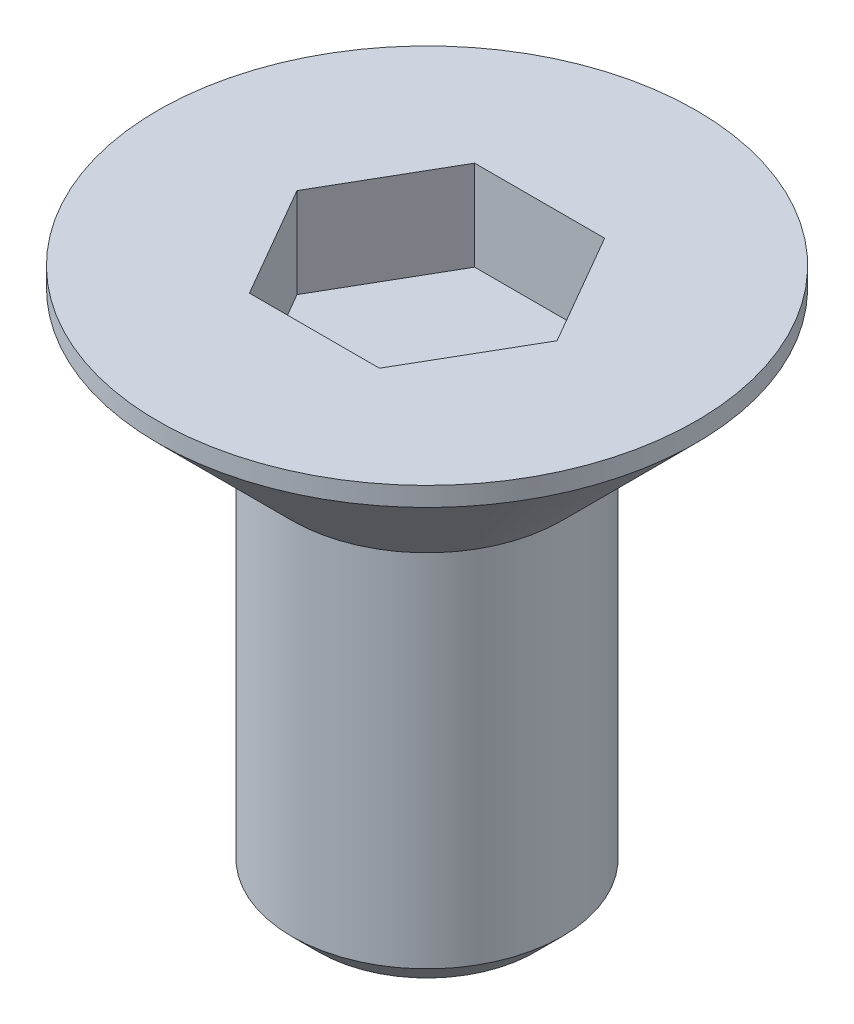
ISO-10303-21;
HEADER;
FILE_DESCRIPTION(('STEP AP214'),'2;1');
FILE_NAME('part.step','',(''),(''),'','','');
FILE_SCHEMA(('AUTOMOTIVE_DESIGN { 1 0 10303 214 1 1 1 1 }'));
ENDSEC;
DATA;
#1=APPLICATION_CONTEXT('core data for automotive mechanical design processes');
#2=APPLICATION_PROTOCOL_DEFINITION('international standard','automotive_design',2000,#1);
#3=PRODUCT_CONTEXT('',#1,'mechanical');
#4=PRODUCT('Part','Part','',(#3));
#5=PRODUCT_RELATED_PRODUCT_CATEGORY('part','',(#4));
#6=PRODUCT_DEFINITION_FORMATION('','',#4);
#7=PRODUCT_DEFINITION_CONTEXT('part definition',#1,'design');
#8=PRODUCT_DEFINITION('design','',#6,#7);
#9=PRODUCT_DEFINITION_SHAPE('','',#8);
#10=(LENGTH_UNIT() NAMED_UNIT(*) SI_UNIT(.MILLI.,.METRE.));
#11=(NAMED_UNIT(*) PLANE_ANGLE_UNIT() SI_UNIT($,.RADIAN.));
#12=(NAMED_UNIT(*) SI_UNIT($,.STERADIAN.) SOLID_ANGLE_UNIT());
#13=UNCERTAINTY_MEASURE_WITH_UNIT(LENGTH_MEASURE(1.E-05),#10,'distance_accuracy_value','');
#14=(GEOMETRIC_REPRESENTATION_CONTEXT(3) GLOBAL_UNCERTAINTY_ASSIGNED_CONTEXT((#13)) GLOBAL_UNIT_ASSIGNED_CONTEXT((#10,
#11,#12)) REPRESENTATION_CONTEXT('',''));
#15=CARTESIAN_POINT('',(0.,0.,0.));
#16=DIRECTION('',(0.,0.,1.));
#17=DIRECTION('',(1.,0.,0.));
#18=AXIS2_PLACEMENT_3D('',#15,#16,#17);
#19=CARTESIAN_POINT('',(0.,0.,0.));
#20=DIRECTION('',(0.,-1.,0.));
#21=DIRECTION('',(0.,0.,-1.));
#22=AXIS2_PLACEMENT_3D('',#19,#20,#21);
#23=PLANE('',#22);
#24=DIRECTION('',(-0.5,0.,0.866025403784439));
#25=VECTOR('',#24,1.);
#26=CARTESIAN_POINT('',(-0.721687836487032,0.,-1.25));
#27=LINE('',#26,#25);
#28=CARTESIAN_POINT('',(-0.721687836487032,0.,-1.25));
#29=VERTEX_POINT('',#28);
#30=CARTESIAN_POINT('',(-1.44337567297406,0.,0.));
#31=VERTEX_POINT('',#30);
#32=EDGE_CURVE('E123',#29,#31,#27,.T.);
#33=ORIENTED_EDGE('',*,*,#32,.F.);
#34=DIRECTION('',(-1.,0.,0.));
#35=VECTOR('',#34,1.);
#36=CARTESIAN_POINT('',(0.721687836487033,0.,-1.25));
#37=LINE('',#36,#35);
#38=CARTESIAN_POINT('',(0.721687836487033,0.,-1.25));
#39=VERTEX_POINT('',#38);
#40=EDGE_CURVE('E49',#39,#29,#37,.T.);
#41=ORIENTED_EDGE('',*,*,#40,.F.);
#42=DIRECTION('',(-0.5,0.,-0.866025403784439));
#43=VECTOR('',#42,1.);
#44=CARTESIAN_POINT('',(1.44337567297406,0.,0.));
#45=LINE('',#44,#43);
#46=CARTESIAN_POINT('',(1.44337567297406,0.,0.));
#47=VERTEX_POINT('',#46);
#48=EDGE_CURVE('E132',#47,#39,#45,.T.);
#49=ORIENTED_EDGE('',*,*,#48,.F.);
#50=DIRECTION('',(0.5,0.,-0.866025403784438));
#51=VECTOR('',#50,1.);
#52=CARTESIAN_POINT('',(0.721687836487032,0.,1.25));
#53=LINE('',#52,#51);
#54=CARTESIAN_POINT('',(0.721687836487032,0.,1.25));
#55=VERTEX_POINT('',#54);
#56=EDGE_CURVE('E130',#55,#47,#53,.T.);
#57=ORIENTED_EDGE('',*,*,#56,.F.);
#58=DIRECTION('',(1.,0.,0.));
#59=VECTOR('',#58,1.);
#60=CARTESIAN_POINT('',(-0.721687836487033,0.,1.25));
#61=LINE('',#60,#59);
#62=CARTESIAN_POINT('',(-0.721687836487033,0.,1.25));
#63=VERTEX_POINT('',#62);
#64=EDGE_CURVE('E97',#63,#55,#61,.T.);
#65=ORIENTED_EDGE('',*,*,#64,.F.);
#66=DIRECTION('',(0.5,0.,0.866025403784439));
#67=VECTOR('',#66,1.);
#68=CARTESIAN_POINT('',(-1.44337567297406,0.,0.));
#69=LINE('',#68,#67);
#70=EDGE_CURVE('E126',#31,#63,#69,.T.);
#71=ORIENTED_EDGE('',*,*,#70,.F.);
#72=EDGE_LOOP('',(#33,#41,#49,#57,#65,#71));
#73=FACE_BOUND('',#72,.T.);
#74=CARTESIAN_POINT('',(0.,0.,0.));
#75=DIRECTION('',(0.,-1.,0.));
#76=DIRECTION('',(0.,0.,-1.));
#77=AXIS2_PLACEMENT_3D('',#74,#75,#76);
#78=CIRCLE('',#77,2.98786796564402);
#79=CARTESIAN_POINT('',(0.,0.,-2.98786796564402));
#80=VERTEX_POINT('',#79);
#81=EDGE_CURVE('E144',#80,#80,#78,.F.);
#82=ORIENTED_EDGE('',*,*,#81,.T.);
#83=EDGE_LOOP('',(#82));
#84=FACE_BOUND('',#83,.T.);
#85=ADVANCED_FACE('F34',(#73,#84),#23,.F.);
#86=CARTESIAN_POINT('',(0.,-1.7,0.));
#87=DIRECTION('',(0.,1.,0.));
#88=DIRECTION('',(0.,0.,1.));
#89=AXIS2_PLACEMENT_3D('',#86,#87,#88);
#90=CONICAL_SURFACE('',#89,1.5,0.785398163397443);
#91=CARTESIAN_POINT('',(0.,-0.212132034355965,0.));
#92=DIRECTION('',(0.,-1.,0.));
#93=DIRECTION('',(0.,0.,-1.));
#94=AXIS2_PLACEMENT_3D('',#91,#92,#93);
#95=CIRCLE('',#94,2.98786796564402);
#96=CARTESIAN_POINT('',(0.,-0.212132034355965,-2.98786796564402));
#97=VERTEX_POINT('',#96);
#98=EDGE_CURVE('E147',#97,#97,#95,.T.);
#99=ORIENTED_EDGE('',*,*,#98,.T.);
#100=EDGE_LOOP('',(#99));
#101=FACE_BOUND('',#100,.T.);
#102=CARTESIAN_POINT('',(0.,-1.7,0.));
#103=DIRECTION('',(0.,1.,0.));
#104=DIRECTION('',(0.,0.,1.));
#105=AXIS2_PLACEMENT_3D('',#102,#103,#104);
#106=CIRCLE('',#105,1.5);
#107=CARTESIAN_POINT('',(0.,-1.7,1.5));
#108=VERTEX_POINT('',#107);
#109=EDGE_CURVE('E136',#108,#108,#106,.T.);
#110=ORIENTED_EDGE('',*,*,#109,.T.);
#111=EDGE_LOOP('',(#110));
#112=FACE_BOUND('',#111,.T.);
#113=ADVANCED_FACE('F169',(#101,#112),#90,.T.);
#114=CARTESIAN_POINT('',(0.,0.,0.));
#115=DIRECTION('',(0.,1.,0.));
#116=DIRECTION('',(0.,0.,1.));
#117=AXIS2_PLACEMENT_3D('',#114,#115,#116);
#118=CYLINDRICAL_SURFACE('',#117,1.5);
#119=CARTESIAN_POINT('',(0.,-5.7,0.));
#120=DIRECTION('',(0.,1.,0.));
#121=DIRECTION('',(0.,0.,1.));
#122=AXIS2_PLACEMENT_3D('',#119,#120,#121);
#123=CIRCLE('',#122,1.5);
#124=CARTESIAN_POINT('',(0.,-5.7,1.5));
#125=VERTEX_POINT('',#124);
#126=EDGE_CURVE('E42',#125,#125,#123,.T.);
#127=ORIENTED_EDGE('',*,*,#126,.T.);
#128=EDGE_LOOP('',(#127));
#129=FACE_BOUND('',#128,.T.);
#130=ORIENTED_EDGE('',*,*,#109,.F.);
#131=EDGE_LOOP('',(#130));
#132=FACE_BOUND('',#131,.T.);
#133=ADVANCED_FACE('F152',(#129,#132),#118,.T.);
#134=CARTESIAN_POINT('',(1.5,-6.,0.));
#135=DIRECTION('',(0.,1.,0.));
#136=DIRECTION('',(0.,0.,1.));
#137=AXIS2_PLACEMENT_3D('',#134,#135,#136);
#138=PLANE('',#137);
#139=CARTESIAN_POINT('',(0.,-6.,0.));
#140=DIRECTION('',(0.,1.,0.));
#141=DIRECTION('',(0.,0.,1.));
#142=AXIS2_PLACEMENT_3D('',#139,#140,#141);
#143=CIRCLE('',#142,1.2);
#144=CARTESIAN_POINT('',(0.,-6.,1.2));
#145=VERTEX_POINT('',#144);
#146=EDGE_CURVE('E11',#145,#145,#143,.F.);
#147=ORIENTED_EDGE('',*,*,#146,.T.);
#148=EDGE_LOOP('',(#147));
#149=FACE_BOUND('',#148,.T.);
#150=ADVANCED_FACE('F165',(#149),#138,.F.);
#151=CARTESIAN_POINT('',(0.,0.,0.));
#152=DIRECTION('',(0.,-1.,0.));
#153=DIRECTION('',(0.,0.,-1.));
#154=AXIS2_PLACEMENT_3D('',#151,#152,#153);
#155=CYLINDRICAL_SURFACE('',#154,2.98786796564402);
#156=ORIENTED_EDGE('',*,*,#98,.F.);
#157=EDGE_LOOP('',(#156));
#158=FACE_BOUND('',#157,.T.);
#159=ORIENTED_EDGE('',*,*,#81,.F.);
#160=EDGE_LOOP('',(#159));
#161=FACE_BOUND('',#160,.T.);
#162=ADVANCED_FACE('F157',(#158,#161),#155,.T.);
#163=CARTESIAN_POINT('',(0.,-5.7,0.));
#164=DIRECTION('',(0.,1.,0.));
#165=DIRECTION('',(0.,0.,1.));
#166=AXIS2_PLACEMENT_3D('',#163,#164,#165);
#167=CONICAL_SURFACE('',#166,1.5,0.785398163397448);
#168=ORIENTED_EDGE('',*,*,#146,.F.);
#169=EDGE_LOOP('',(#168));
#170=FACE_BOUND('',#169,.T.);
#171=ORIENTED_EDGE('',*,*,#126,.F.);
#172=EDGE_LOOP('',(#171));
#173=FACE_BOUND('',#172,.T.);
#174=ADVANCED_FACE('F36',(#170,#173),#167,.T.);
#175=CARTESIAN_POINT('',(0.721687836487033,-1.,-1.25));
#176=DIRECTION('',(0.,0.,-1.));
#177=DIRECTION('',(-1.,0.,0.));
#178=AXIS2_PLACEMENT_3D('',#175,#176,#177);
#179=PLANE('',#178);
#180=ORIENTED_EDGE('',*,*,#40,.T.);
#181=DIRECTION('',(0.,1.,0.));
#182=VECTOR('',#181,1.);
#183=CARTESIAN_POINT('',(-0.721687836487032,-1.,-1.25));
#184=LINE('',#183,#182);
#185=CARTESIAN_POINT('',(-0.721687836487032,-1.,-1.25));
#186=VERTEX_POINT('',#185);
#187=EDGE_CURVE('E79',#186,#29,#184,.T.);
#188=ORIENTED_EDGE('',*,*,#187,.F.);
#189=DIRECTION('',(-1.,0.,0.));
#190=VECTOR('',#189,1.);
#191=CARTESIAN_POINT('',(0.721687836487033,-1.,-1.25));
#192=LINE('',#191,#190);
#193=CARTESIAN_POINT('',(0.721687836487033,-1.,-1.25));
#194=VERTEX_POINT('',#193);
#195=EDGE_CURVE('E134',#194,#186,#192,.T.);
#196=ORIENTED_EDGE('',*,*,#195,.F.);
#197=DIRECTION('',(0.,1.,0.));
#198=VECTOR('',#197,1.);
#199=CARTESIAN_POINT('',(0.721687836487033,-1.,-1.25));
#200=LINE('',#199,#198);
#201=EDGE_CURVE('E57',#194,#39,#200,.T.);
#202=ORIENTED_EDGE('',*,*,#201,.T.);
#203=EDGE_LOOP('',(#180,#188,#196,#202));
#204=FACE_BOUND('',#203,.T.);
#205=ADVANCED_FACE('F156',(#204),#179,.F.);
#206=CARTESIAN_POINT('',(1.44337567297406,-1.,0.));
#207=DIRECTION('',(0.866025403784439,0.,-0.5));
#208=DIRECTION('',(-0.5,0.,-0.866025403784439));
#209=AXIS2_PLACEMENT_3D('',#206,#207,#208);
#210=PLANE('',#209);
#211=ORIENTED_EDGE('',*,*,#48,.T.);
#212=ORIENTED_EDGE('',*,*,#201,.F.);
#213=DIRECTION('',(-0.5,0.,-0.866025403784439));
#214=VECTOR('',#213,1.);
#215=CARTESIAN_POINT('',(1.44337567297406,-1.,0.));
#216=LINE('',#215,#214);
#217=CARTESIAN_POINT('',(1.44337567297406,-1.,0.));
#218=VERTEX_POINT('',#217);
#219=EDGE_CURVE('E109',#218,#194,#216,.T.);
#220=ORIENTED_EDGE('',*,*,#219,.F.);
#221=DIRECTION('',(0.,1.,0.));
#222=VECTOR('',#221,1.);
#223=CARTESIAN_POINT('',(1.44337567297406,-1.,0.));
#224=LINE('',#223,#222);
#225=EDGE_CURVE('E101',#218,#47,#224,.T.);
#226=ORIENTED_EDGE('',*,*,#225,.T.);
#227=EDGE_LOOP('',(#211,#212,#220,#226));
#228=FACE_BOUND('',#227,.T.);
#229=ADVANCED_FACE('F163',(#228),#210,.F.);
#230=CARTESIAN_POINT('',(0.721687836487032,-1.,1.25));
#231=DIRECTION('',(0.866025403784439,0.,0.5));
#232=DIRECTION('',(0.5,0.,-0.866025403784438));
#233=AXIS2_PLACEMENT_3D('',#230,#231,#232);
#234=PLANE('',#233);
#235=ORIENTED_EDGE('',*,*,#56,.T.);
#236=ORIENTED_EDGE('',*,*,#225,.F.);
#237=DIRECTION('',(0.5,0.,-0.866025403784438));
#238=VECTOR('',#237,1.);
#239=CARTESIAN_POINT('',(0.721687836487032,-1.,1.25));
#240=LINE('',#239,#238);
#241=CARTESIAN_POINT('',(0.721687836487032,-1.,1.25));
#242=VERTEX_POINT('',#241);
#243=EDGE_CURVE('E105',#242,#218,#240,.T.);
#244=ORIENTED_EDGE('',*,*,#243,.F.);
#245=DIRECTION('',(0.,1.,0.));
#246=VECTOR('',#245,1.);
#247=CARTESIAN_POINT('',(0.721687836487032,-1.,1.25));
#248=LINE('',#247,#246);
#249=EDGE_CURVE('E90',#242,#55,#248,.T.);
#250=ORIENTED_EDGE('',*,*,#249,.T.);
#251=EDGE_LOOP('',(#235,#236,#244,#250));
#252=FACE_BOUND('',#251,.T.);
#253=ADVANCED_FACE('F106',(#252),#234,.F.);
#254=CARTESIAN_POINT('',(-0.721687836487033,-1.,1.25));
#255=DIRECTION('',(0.,0.,1.));
#256=DIRECTION('',(1.,0.,0.));
#257=AXIS2_PLACEMENT_3D('',#254,#255,#256);
#258=PLANE('',#257);
#259=ORIENTED_EDGE('',*,*,#64,.T.);
#260=ORIENTED_EDGE('',*,*,#249,.F.);
#261=DIRECTION('',(1.,0.,0.));
#262=VECTOR('',#261,1.);
#263=CARTESIAN_POINT('',(-0.721687836487033,-1.,1.25));
#264=LINE('',#263,#262);
#265=CARTESIAN_POINT('',(-0.721687836487033,-1.,1.25));
#266=VERTEX_POINT('',#265);
#267=EDGE_CURVE('E94',#266,#242,#264,.T.);
#268=ORIENTED_EDGE('',*,*,#267,.F.);
#269=DIRECTION('',(0.,1.,0.));
#270=VECTOR('',#269,1.);
#271=CARTESIAN_POINT('',(-0.721687836487033,-1.,1.25));
#272=LINE('',#271,#270);
#273=EDGE_CURVE('E102',#266,#63,#272,.T.);
#274=ORIENTED_EDGE('',*,*,#273,.T.);
#275=EDGE_LOOP('',(#259,#260,#268,#274));
#276=FACE_BOUND('',#275,.T.);
#277=ADVANCED_FACE('F92',(#276),#258,.F.);
#278=CARTESIAN_POINT('',(-1.44337567297406,-1.,0.));
#279=DIRECTION('',(-0.866025403784439,0.,0.5));
#280=DIRECTION('',(0.5,0.,0.866025403784439));
#281=AXIS2_PLACEMENT_3D('',#278,#279,#280);
#282=PLANE('',#281);
#283=ORIENTED_EDGE('',*,*,#70,.T.);
#284=ORIENTED_EDGE('',*,*,#273,.F.);
#285=DIRECTION('',(0.5,0.,0.866025403784439));
#286=VECTOR('',#285,1.);
#287=CARTESIAN_POINT('',(-1.44337567297406,-1.,0.));
#288=LINE('',#287,#286);
#289=CARTESIAN_POINT('',(-1.44337567297406,-1.,0.));
#290=VERTEX_POINT('',#289);
#291=EDGE_CURVE('E115',#290,#266,#288,.T.);
#292=ORIENTED_EDGE('',*,*,#291,.F.);
#293=DIRECTION('',(0.,1.,0.));
#294=VECTOR('',#293,1.);
#295=CARTESIAN_POINT('',(-1.44337567297406,-1.,0.));
#296=LINE('',#295,#294);
#297=EDGE_CURVE('E139',#290,#31,#296,.T.);
#298=ORIENTED_EDGE('',*,*,#297,.T.);
#299=EDGE_LOOP('',(#283,#284,#292,#298));
#300=FACE_BOUND('',#299,.T.);
#301=ADVANCED_FACE('F188',(#300),#282,.F.);
#302=CARTESIAN_POINT('',(-0.721687836487032,-1.,-1.25));
#303=DIRECTION('',(-0.866025403784439,0.,-0.5));
#304=DIRECTION('',(-0.5,0.,0.866025403784439));
#305=AXIS2_PLACEMENT_3D('',#302,#303,#304);
#306=PLANE('',#305);
#307=ORIENTED_EDGE('',*,*,#32,.T.);
#308=ORIENTED_EDGE('',*,*,#297,.F.);
#309=DIRECTION('',(-0.5,0.,0.866025403784439));
#310=VECTOR('',#309,1.);
#311=CARTESIAN_POINT('',(-0.721687836487032,-1.,-1.25));
#312=LINE('',#311,#310);
#313=EDGE_CURVE('E117',#186,#290,#312,.T.);
#314=ORIENTED_EDGE('',*,*,#313,.F.);
#315=ORIENTED_EDGE('',*,*,#187,.T.);
#316=EDGE_LOOP('',(#307,#308,#314,#315));
#317=FACE_BOUND('',#316,.T.);
#318=ADVANCED_FACE('F185',(#317),#306,.F.);
#319=CARTESIAN_POINT('',(-0.721687836487032,-1.,-1.25));
#320=DIRECTION('',(0.,1.,0.));
#321=DIRECTION('',(0.,0.,1.));
#322=AXIS2_PLACEMENT_3D('',#319,#320,#321);
#323=PLANE('',#322);
#324=ORIENTED_EDGE('',*,*,#195,.T.);
#325=ORIENTED_EDGE('',*,*,#313,.T.);
#326=ORIENTED_EDGE('',*,*,#291,.T.);
#327=ORIENTED_EDGE('',*,*,#267,.T.);
#328=ORIENTED_EDGE('',*,*,#243,.T.);
#329=ORIENTED_EDGE('',*,*,#219,.T.);
#330=EDGE_LOOP('',(#324,#325,#326,#327,#328,#329));
#331=FACE_BOUND('',#330,.T.);
#332=ADVANCED_FACE('F112',(#331),#323,.T.);
#333=CLOSED_SHELL('',(#85,#113,#133,#150,#162,#174,#205,#229,#253,#277,#301,#318,#332));
#334=MANIFOLD_SOLID_BREP('B2',#333);
#335=ADVANCED_BREP_SHAPE_REPRESENTATION('',(#18,#334),#14);
#336=SHAPE_DEFINITION_REPRESENTATION(#9,#335);
ENDSEC;
END-ISO-10303-21;
